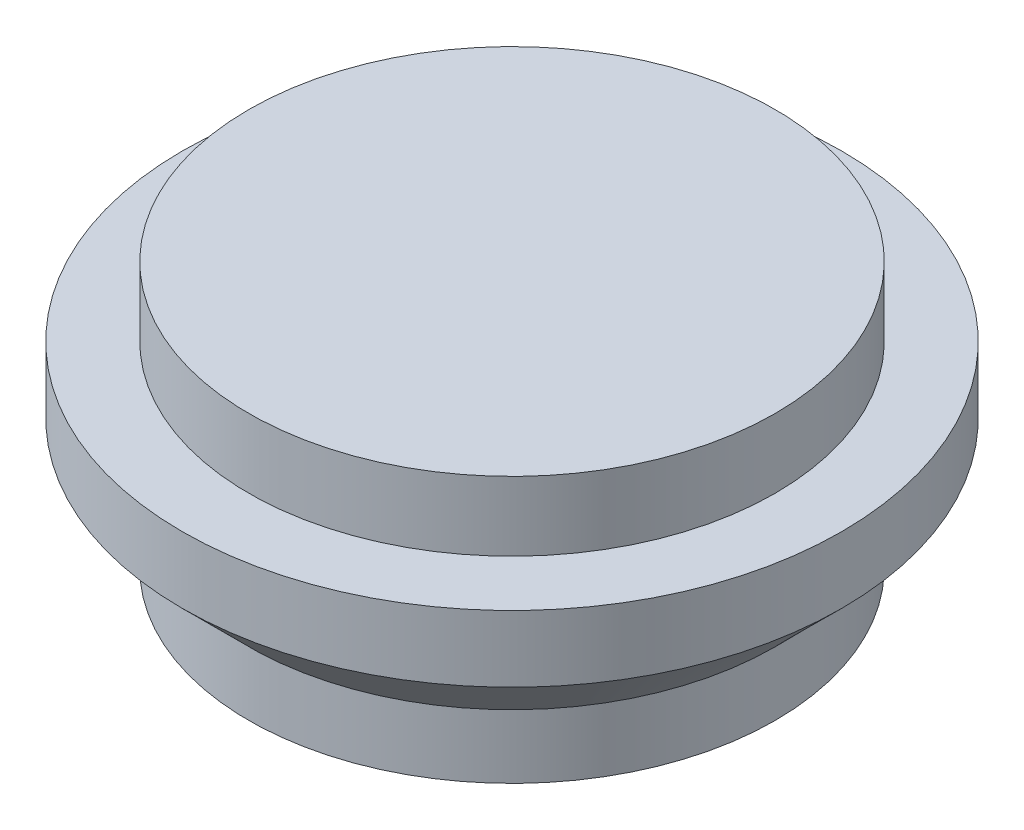
ISO-10303-21;
HEADER;
FILE_DESCRIPTION(('STEP AP214'),'2;1');
FILE_NAME('part.step','',(''),(''),'','','');
FILE_SCHEMA(('AUTOMOTIVE_DESIGN { 1 0 10303 214 1 1 1 1 }'));
ENDSEC;
DATA;
#1=APPLICATION_CONTEXT('core data for automotive mechanical design processes');
#2=APPLICATION_PROTOCOL_DEFINITION('international standard','automotive_design',2000,#1);
#3=PRODUCT_CONTEXT('',#1,'mechanical');
#4=PRODUCT('Part','Part','',(#3));
#5=PRODUCT_RELATED_PRODUCT_CATEGORY('part','',(#4));
#6=PRODUCT_DEFINITION_FORMATION('','',#4);
#7=PRODUCT_DEFINITION_CONTEXT('part definition',#1,'design');
#8=PRODUCT_DEFINITION('design','',#6,#7);
#9=PRODUCT_DEFINITION_SHAPE('','',#8);
#10=(LENGTH_UNIT() NAMED_UNIT(*) SI_UNIT(.MILLI.,.METRE.));
#11=(NAMED_UNIT(*) PLANE_ANGLE_UNIT() SI_UNIT($,.RADIAN.));
#12=(NAMED_UNIT(*) SI_UNIT($,.STERADIAN.) SOLID_ANGLE_UNIT());
#13=UNCERTAINTY_MEASURE_WITH_UNIT(LENGTH_MEASURE(1.E-05),#10,'distance_accuracy_value','');
#14=(GEOMETRIC_REPRESENTATION_CONTEXT(3) GLOBAL_UNCERTAINTY_ASSIGNED_CONTEXT((#13)) GLOBAL_UNIT_ASSIGNED_CONTEXT((#10,
#11,#12)) REPRESENTATION_CONTEXT('',''));
#15=CARTESIAN_POINT('',(0.,0.,0.));
#16=DIRECTION('',(0.,0.,1.));
#17=DIRECTION('',(1.,0.,0.));
#18=AXIS2_PLACEMENT_3D('',#15,#16,#17);
#19=CARTESIAN_POINT('',(0.,11.303,0.));
#20=DIRECTION('',(0.,-1.,0.));
#21=DIRECTION('',(1.,0.,0.));
#22=AXIS2_PLACEMENT_3D('',#19,#20,#21);
#23=CONICAL_SURFACE('',#22,0.,0.785398163397443);
#24=CARTESIAN_POINT('',(0.,0.,0.));
#25=DIRECTION('',(0.,1.,0.));
#26=DIRECTION('',(-1.,0.,0.));
#27=AXIS2_PLACEMENT_3D('',#24,#25,#26);
#28=CIRCLE('',#27,11.3029999999999);
#29=CARTESIAN_POINT('',(-11.3029999999999,0.,0.));
#30=VERTEX_POINT('',#29);
#31=EDGE_CURVE('E51',#30,#30,#28,.T.);
#32=ORIENTED_EDGE('',*,*,#31,.F.);
#33=EDGE_LOOP('',(#32));
#34=FACE_BOUND('',#33,.T.);
#35=CARTESIAN_POINT('',(0.,11.303,0.));
#36=VERTEX_POINT('',#35);
#37=VERTEX_LOOP('',#36);
#38=FACE_BOUND('',#37,.T.);
#39=ADVANCED_FACE('F32',(#34,#38),#23,.F.);
#40=CARTESIAN_POINT('',(12.573,12.7,0.));
#41=DIRECTION('',(0.,-1.,0.));
#42=DIRECTION('',(1.,0.,0.));
#43=AXIS2_PLACEMENT_3D('',#40,#41,#42);
#44=PLANE('',#43);
#45=CARTESIAN_POINT('',(0.,12.7,0.));
#46=DIRECTION('',(0.,1.,0.));
#47=DIRECTION('',(-1.,0.,0.));
#48=AXIS2_PLACEMENT_3D('',#45,#46,#47);
#49=CIRCLE('',#48,12.573);
#50=CARTESIAN_POINT('',(-12.573,12.6999999999999,0.));
#51=VERTEX_POINT('',#50);
#52=EDGE_CURVE('E11',#51,#51,#49,.T.);
#53=ORIENTED_EDGE('',*,*,#52,.T.);
#54=EDGE_LOOP('',(#53));
#55=FACE_BOUND('',#54,.T.);
#56=ADVANCED_FACE('F42',(#55),#44,.F.);
#57=CARTESIAN_POINT('',(0.,12.7,0.));
#58=DIRECTION('',(0.,1.,0.));
#59=DIRECTION('',(-1.,0.,0.));
#60=AXIS2_PLACEMENT_3D('',#57,#58,#59);
#61=CYLINDRICAL_SURFACE('',#60,12.573);
#62=ORIENTED_EDGE('',*,*,#52,.F.);
#63=EDGE_LOOP('',(#62));
#64=FACE_BOUND('',#63,.T.);
#65=CARTESIAN_POINT('',(0.,9.39799999999995,0.));
#66=DIRECTION('',(0.,1.,0.));
#67=DIRECTION('',(-1.,0.,0.));
#68=AXIS2_PLACEMENT_3D('',#65,#66,#67);
#69=CIRCLE('',#68,12.573);
#70=CARTESIAN_POINT('',(-12.573,9.3979999999999,0.));
#71=VERTEX_POINT('',#70);
#72=EDGE_CURVE('E38',#71,#71,#69,.T.);
#73=ORIENTED_EDGE('',*,*,#72,.T.);
#74=EDGE_LOOP('',(#73));
#75=FACE_BOUND('',#74,.T.);
#76=ADVANCED_FACE('F47',(#64,#75),#61,.T.);
#77=CARTESIAN_POINT('',(12.573,9.39799999999999,0.));
#78=DIRECTION('',(0.,-1.,0.));
#79=DIRECTION('',(1.,0.,0.));
#80=AXIS2_PLACEMENT_3D('',#77,#78,#79);
#81=PLANE('',#80);
#82=ORIENTED_EDGE('',*,*,#72,.F.);
#83=EDGE_LOOP('',(#82));
#84=FACE_BOUND('',#83,.T.);
#85=CARTESIAN_POINT('',(0.,9.39799999999994,0.));
#86=DIRECTION('',(0.,1.,0.));
#87=DIRECTION('',(-1.,0.,0.));
#88=AXIS2_PLACEMENT_3D('',#85,#86,#87);
#89=CIRCLE('',#88,15.748);
#90=CARTESIAN_POINT('',(-15.748,9.39799999999988,0.));
#91=VERTEX_POINT('',#90);
#92=EDGE_CURVE('E64',#91,#91,#89,.T.);
#93=ORIENTED_EDGE('',*,*,#92,.T.);
#94=EDGE_LOOP('',(#93));
#95=FACE_BOUND('',#94,.T.);
#96=ADVANCED_FACE('F70',(#84,#95),#81,.F.);
#97=CARTESIAN_POINT('',(0.,12.7,0.));
#98=DIRECTION('',(0.,1.,0.));
#99=DIRECTION('',(-1.,0.,0.));
#100=AXIS2_PLACEMENT_3D('',#97,#98,#99);
#101=CYLINDRICAL_SURFACE('',#100,15.748);
#102=ORIENTED_EDGE('',*,*,#92,.F.);
#103=EDGE_LOOP('',(#102));
#104=FACE_BOUND('',#103,.T.);
#105=CARTESIAN_POINT('',(0.,6.22299999999994,0.));
#106=DIRECTION('',(0.,1.,0.));
#107=DIRECTION('',(-1.,0.,0.));
#108=AXIS2_PLACEMENT_3D('',#105,#106,#107);
#109=CIRCLE('',#108,15.748);
#110=CARTESIAN_POINT('',(-15.748,6.22299999999988,0.));
#111=VERTEX_POINT('',#110);
#112=EDGE_CURVE('E61',#111,#111,#109,.T.);
#113=ORIENTED_EDGE('',*,*,#112,.T.);
#114=EDGE_LOOP('',(#113));
#115=FACE_BOUND('',#114,.T.);
#116=ADVANCED_FACE('F73',(#104,#115),#101,.T.);
#117=CARTESIAN_POINT('',(0.,3.04799999999994,0.));
#118=DIRECTION('',(0.,1.,0.));
#119=DIRECTION('',(-1.,0.,0.));
#120=AXIS2_PLACEMENT_3D('',#117,#118,#119);
#121=CONICAL_SURFACE('',#120,12.573,0.78539816339745);
#122=ORIENTED_EDGE('',*,*,#112,.F.);
#123=EDGE_LOOP('',(#122));
#124=FACE_BOUND('',#123,.T.);
#125=CARTESIAN_POINT('',(0.,3.04799999999994,0.));
#126=DIRECTION('',(0.,1.,0.));
#127=DIRECTION('',(-1.,0.,0.));
#128=AXIS2_PLACEMENT_3D('',#125,#126,#127);
#129=CIRCLE('',#128,12.573);
#130=CARTESIAN_POINT('',(-12.5729999999999,3.04799999999989,0.));
#131=VERTEX_POINT('',#130);
#132=EDGE_CURVE('E56',#131,#131,#129,.T.);
#133=ORIENTED_EDGE('',*,*,#132,.T.);
#134=EDGE_LOOP('',(#133));
#135=FACE_BOUND('',#134,.T.);
#136=ADVANCED_FACE('F79',(#124,#135),#121,.T.);
#137=CARTESIAN_POINT('',(0.,12.7,0.));
#138=DIRECTION('',(0.,1.,0.));
#139=DIRECTION('',(-1.,0.,0.));
#140=AXIS2_PLACEMENT_3D('',#137,#138,#139);
#141=CYLINDRICAL_SURFACE('',#140,12.573);
#142=ORIENTED_EDGE('',*,*,#132,.F.);
#143=EDGE_LOOP('',(#142));
#144=FACE_BOUND('',#143,.T.);
#145=CARTESIAN_POINT('',(0.,0.,0.));
#146=DIRECTION('',(0.,1.,0.));
#147=DIRECTION('',(-1.,0.,0.));
#148=AXIS2_PLACEMENT_3D('',#145,#146,#147);
#149=CIRCLE('',#148,12.5729999999999);
#150=CARTESIAN_POINT('',(-12.5729999999999,0.,0.));
#151=VERTEX_POINT('',#150);
#152=EDGE_CURVE('E53',#151,#151,#149,.T.);
#153=ORIENTED_EDGE('',*,*,#152,.T.);
#154=EDGE_LOOP('',(#153));
#155=FACE_BOUND('',#154,.T.);
#156=ADVANCED_FACE('F85',(#144,#155),#141,.T.);
#157=CARTESIAN_POINT('',(11.303,0.,0.));
#158=DIRECTION('',(0.,1.,0.));
#159=DIRECTION('',(-1.,0.,0.));
#160=AXIS2_PLACEMENT_3D('',#157,#158,#159);
#161=PLANE('',#160);
#162=ORIENTED_EDGE('',*,*,#152,.F.);
#163=EDGE_LOOP('',(#162));
#164=FACE_BOUND('',#163,.T.);
#165=ORIENTED_EDGE('',*,*,#31,.T.);
#166=EDGE_LOOP('',(#165));
#167=FACE_BOUND('',#166,.T.);
#168=ADVANCED_FACE('F91',(#164,#167),#161,.F.);
#169=CLOSED_SHELL('',(#39,#56,#76,#96,#116,#136,#156,#168));
#170=MANIFOLD_SOLID_BREP('B2',#169);
#171=ADVANCED_BREP_SHAPE_REPRESENTATION('',(#18,#170),#14);
#172=SHAPE_DEFINITION_REPRESENTATION(#9,#171);
ENDSEC;
END-ISO-10303-21;
